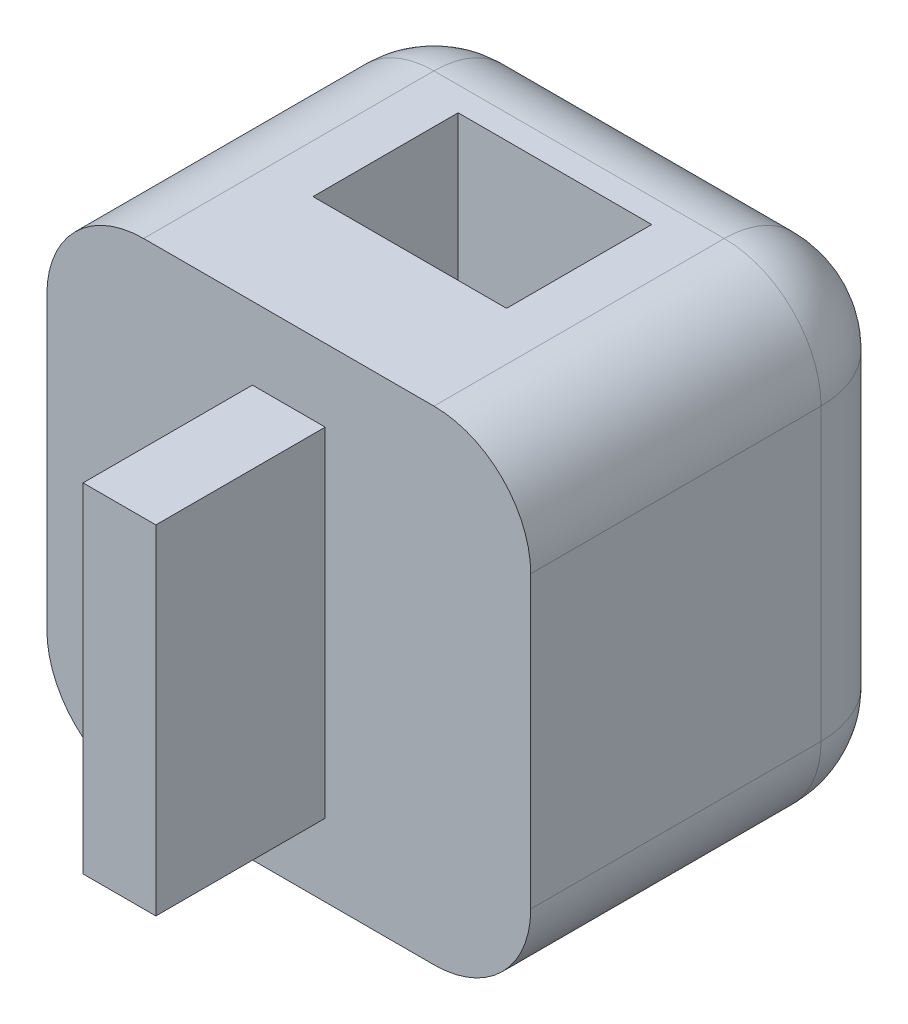
ISO-10303-21;
HEADER;
FILE_DESCRIPTION(('STEP AP214'),'2;1');
FILE_NAME('part.step','',(''),(''),'','','');
FILE_SCHEMA(('AUTOMOTIVE_DESIGN { 1 0 10303 214 1 1 1 1 }'));
ENDSEC;
DATA;
#1=APPLICATION_CONTEXT('core data for automotive mechanical design processes');
#2=APPLICATION_PROTOCOL_DEFINITION('international standard','automotive_design',2000,#1);
#3=PRODUCT_CONTEXT('',#1,'mechanical');
#4=PRODUCT('Part','Part','',(#3));
#5=PRODUCT_RELATED_PRODUCT_CATEGORY('part','',(#4));
#6=PRODUCT_DEFINITION_FORMATION('','',#4);
#7=PRODUCT_DEFINITION_CONTEXT('part definition',#1,'design');
#8=PRODUCT_DEFINITION('design','',#6,#7);
#9=PRODUCT_DEFINITION_SHAPE('','',#8);
#10=(LENGTH_UNIT() NAMED_UNIT(*) SI_UNIT(.MILLI.,.METRE.));
#11=(NAMED_UNIT(*) PLANE_ANGLE_UNIT() SI_UNIT($,.RADIAN.));
#12=(NAMED_UNIT(*) SI_UNIT($,.STERADIAN.) SOLID_ANGLE_UNIT());
#13=UNCERTAINTY_MEASURE_WITH_UNIT(LENGTH_MEASURE(1.E-05),#10,'distance_accuracy_value','');
#14=(GEOMETRIC_REPRESENTATION_CONTEXT(3) GLOBAL_UNCERTAINTY_ASSIGNED_CONTEXT((#13)) GLOBAL_UNIT_ASSIGNED_CONTEXT((#10,
#11,#12)) REPRESENTATION_CONTEXT('',''));
#15=CARTESIAN_POINT('',(0.,0.,0.));
#16=DIRECTION('',(0.,0.,1.));
#17=DIRECTION('',(1.,0.,0.));
#18=AXIS2_PLACEMENT_3D('',#15,#16,#17);
#19=CARTESIAN_POINT('',(0.,0.,8.));
#20=DIRECTION('',(0.,0.,-1.));
#21=DIRECTION('',(-1.,0.,0.));
#22=AXIS2_PLACEMENT_3D('',#19,#20,#21);
#23=PLANE('',#22);
#24=DIRECTION('',(0.,-1.,0.));
#25=VECTOR('',#24,1.);
#26=CARTESIAN_POINT('',(-5.,-5.,8.));
#27=LINE('',#26,#25);
#28=CARTESIAN_POINT('',(-5.,3.,8.));
#29=VERTEX_POINT('',#28);
#30=CARTESIAN_POINT('',(-5.,-3.,8.));
#31=VERTEX_POINT('',#30);
#32=EDGE_CURVE('E230',#29,#31,#27,.T.);
#33=ORIENTED_EDGE('',*,*,#32,.T.);
#34=CARTESIAN_POINT('',(-3.,-3.,8.));
#35=DIRECTION('',(0.,0.,-1.));
#36=DIRECTION('',(-1.,0.,0.));
#37=AXIS2_PLACEMENT_3D('',#34,#35,#36);
#38=CIRCLE('',#37,2.);
#39=CARTESIAN_POINT('',(-3.,-5.,8.));
#40=VERTEX_POINT('',#39);
#41=EDGE_CURVE('E255',#31,#40,#38,.F.);
#42=ORIENTED_EDGE('',*,*,#41,.T.);
#43=DIRECTION('',(1.,0.,0.));
#44=VECTOR('',#43,1.);
#45=CARTESIAN_POINT('',(-5.,-5.,8.));
#46=LINE('',#45,#44);
#47=CARTESIAN_POINT('',(3.,-5.,8.));
#48=VERTEX_POINT('',#47);
#49=EDGE_CURVE('E233',#40,#48,#46,.T.);
#50=ORIENTED_EDGE('',*,*,#49,.T.);
#51=CARTESIAN_POINT('',(3.,-3.,8.));
#52=DIRECTION('',(0.,0.,-1.));
#53=DIRECTION('',(-1.,0.,0.));
#54=AXIS2_PLACEMENT_3D('',#51,#52,#53);
#55=CIRCLE('',#54,2.);
#56=CARTESIAN_POINT('',(5.,-3.,8.));
#57=VERTEX_POINT('',#56);
#58=EDGE_CURVE('E251',#48,#57,#55,.F.);
#59=ORIENTED_EDGE('',*,*,#58,.T.);
#60=DIRECTION('',(0.,1.,0.));
#61=VECTOR('',#60,1.);
#62=CARTESIAN_POINT('',(5.,-5.,8.));
#63=LINE('',#62,#61);
#64=CARTESIAN_POINT('',(5.,3.,8.));
#65=VERTEX_POINT('',#64);
#66=EDGE_CURVE('E218',#57,#65,#63,.T.);
#67=ORIENTED_EDGE('',*,*,#66,.T.);
#68=CARTESIAN_POINT('',(3.,3.,8.));
#69=DIRECTION('',(0.,0.,-1.));
#70=DIRECTION('',(-1.,0.,0.));
#71=AXIS2_PLACEMENT_3D('',#68,#69,#70);
#72=CIRCLE('',#71,2.);
#73=CARTESIAN_POINT('',(3.,5.,8.));
#74=VERTEX_POINT('',#73);
#75=EDGE_CURVE('E249',#65,#74,#72,.F.);
#76=ORIENTED_EDGE('',*,*,#75,.T.);
#77=DIRECTION('',(-1.,0.,0.));
#78=VECTOR('',#77,1.);
#79=CARTESIAN_POINT('',(-5.,5.,8.));
#80=LINE('',#79,#78);
#81=CARTESIAN_POINT('',(-3.,5.,8.));
#82=VERTEX_POINT('',#81);
#83=EDGE_CURVE('E227',#74,#82,#80,.T.);
#84=ORIENTED_EDGE('',*,*,#83,.T.);
#85=CARTESIAN_POINT('',(-3.,3.,8.));
#86=DIRECTION('',(0.,0.,-1.));
#87=DIRECTION('',(-1.,0.,0.));
#88=AXIS2_PLACEMENT_3D('',#85,#86,#87);
#89=CIRCLE('',#88,2.);
#90=EDGE_CURVE('E253',#82,#29,#89,.F.);
#91=ORIENTED_EDGE('',*,*,#90,.T.);
#92=EDGE_LOOP('',(#33,#42,#50,#59,#67,#76,#84,#91));
#93=FACE_BOUND('',#92,.T.);
#94=DIRECTION('',(0.,-1.,0.));
#95=VECTOR('',#94,1.);
#96=CARTESIAN_POINT('',(-0.752429594362617,-3.5,8.));
#97=LINE('',#96,#95);
#98=CARTESIAN_POINT('',(-0.752429594362617,3.5,8.));
#99=VERTEX_POINT('',#98);
#100=CARTESIAN_POINT('',(-0.752429594362617,-3.5,8.));
#101=VERTEX_POINT('',#100);
#102=EDGE_CURVE('E186',#99,#101,#97,.T.);
#103=ORIENTED_EDGE('',*,*,#102,.F.);
#104=DIRECTION('',(-1.,0.,0.));
#105=VECTOR('',#104,1.);
#106=CARTESIAN_POINT('',(0.752429594362617,3.5,8.));
#107=LINE('',#106,#105);
#108=CARTESIAN_POINT('',(0.752429594362617,3.5,8.));
#109=VERTEX_POINT('',#108);
#110=EDGE_CURVE('E183',#109,#99,#107,.T.);
#111=ORIENTED_EDGE('',*,*,#110,.F.);
#112=DIRECTION('',(0.,1.,0.));
#113=VECTOR('',#112,1.);
#114=CARTESIAN_POINT('',(0.752429594362617,-3.5,8.));
#115=LINE('',#114,#113);
#116=CARTESIAN_POINT('',(0.752429594362617,-3.5,8.));
#117=VERTEX_POINT('',#116);
#118=EDGE_CURVE('E311',#117,#109,#115,.T.);
#119=ORIENTED_EDGE('',*,*,#118,.F.);
#120=DIRECTION('',(1.,0.,0.));
#121=VECTOR('',#120,1.);
#122=CARTESIAN_POINT('',(0.752429594362617,-3.5,8.));
#123=LINE('',#122,#121);
#124=EDGE_CURVE('E309',#101,#117,#123,.T.);
#125=ORIENTED_EDGE('',*,*,#124,.F.);
#126=EDGE_LOOP('',(#103,#111,#119,#125));
#127=FACE_BOUND('',#126,.T.);
#128=ADVANCED_FACE('F34',(#93,#127),#23,.F.);
#129=CARTESIAN_POINT('',(5.,-5.,8.));
#130=DIRECTION('',(-1.,0.,0.));
#131=DIRECTION('',(0.,0.,1.));
#132=AXIS2_PLACEMENT_3D('',#129,#130,#131);
#133=PLANE('',#132);
#134=ORIENTED_EDGE('',*,*,#66,.F.);
#135=DIRECTION('',(0.,0.,-1.));
#136=VECTOR('',#135,1.);
#137=CARTESIAN_POINT('',(5.,-3.,8.));
#138=LINE('',#137,#136);
#139=CARTESIAN_POINT('',(5.,-3.,2.));
#140=VERTEX_POINT('',#139);
#141=EDGE_CURVE('E267',#57,#140,#138,.T.);
#142=ORIENTED_EDGE('',*,*,#141,.T.);
#143=DIRECTION('',(0.,1.,0.));
#144=VECTOR('',#143,1.);
#145=CARTESIAN_POINT('',(5.,5.,2.));
#146=LINE('',#145,#144);
#147=CARTESIAN_POINT('',(5.,3.,2.));
#148=VERTEX_POINT('',#147);
#149=EDGE_CURVE('E263',#140,#148,#146,.T.);
#150=ORIENTED_EDGE('',*,*,#149,.T.);
#151=DIRECTION('',(0.,0.,-1.));
#152=VECTOR('',#151,1.);
#153=CARTESIAN_POINT('',(5.,3.,8.));
#154=LINE('',#153,#152);
#155=EDGE_CURVE('E265',#148,#65,#154,.F.);
#156=ORIENTED_EDGE('',*,*,#155,.T.);
#157=EDGE_LOOP('',(#134,#142,#150,#156));
#158=FACE_BOUND('',#157,.T.);
#159=ADVANCED_FACE('F329',(#158),#133,.F.);
#160=CARTESIAN_POINT('',(-5.,5.,8.));
#161=DIRECTION('',(0.,-1.,0.));
#162=DIRECTION('',(0.,0.,-1.));
#163=AXIS2_PLACEMENT_3D('',#160,#161,#162);
#164=PLANE('',#163);
#165=DIRECTION('',(1.,0.,0.));
#166=VECTOR('',#165,1.);
#167=CARTESIAN_POINT('',(-2.,5.,2.5));
#168=LINE('',#167,#166);
#169=CARTESIAN_POINT('',(-2.,5.,2.5));
#170=VERTEX_POINT('',#169);
#171=CARTESIAN_POINT('',(2.,5.,2.5));
#172=VERTEX_POINT('',#171);
#173=EDGE_CURVE('E205',#170,#172,#168,.T.);
#174=ORIENTED_EDGE('',*,*,#173,.T.);
#175=DIRECTION('',(0.,0.,1.));
#176=VECTOR('',#175,1.);
#177=CARTESIAN_POINT('',(2.,5.,2.5));
#178=LINE('',#177,#176);
#179=CARTESIAN_POINT('',(2.,5.,5.5));
#180=VERTEX_POINT('',#179);
#181=EDGE_CURVE('E195',#172,#180,#178,.T.);
#182=ORIENTED_EDGE('',*,*,#181,.T.);
#183=DIRECTION('',(-1.,0.,0.));
#184=VECTOR('',#183,1.);
#185=CARTESIAN_POINT('',(-2.,5.,5.5));
#186=LINE('',#185,#184);
#187=CARTESIAN_POINT('',(-2.,5.,5.5));
#188=VERTEX_POINT('',#187);
#189=EDGE_CURVE('E198',#180,#188,#186,.T.);
#190=ORIENTED_EDGE('',*,*,#189,.T.);
#191=DIRECTION('',(0.,0.,-1.));
#192=VECTOR('',#191,1.);
#193=CARTESIAN_POINT('',(-2.,5.,2.5));
#194=LINE('',#193,#192);
#195=EDGE_CURVE('E202',#188,#170,#194,.T.);
#196=ORIENTED_EDGE('',*,*,#195,.T.);
#197=EDGE_LOOP('',(#174,#182,#190,#196));
#198=FACE_BOUND('',#197,.T.);
#199=DIRECTION('',(-1.,0.,0.));
#200=VECTOR('',#199,1.);
#201=CARTESIAN_POINT('',(-5.,5.,2.));
#202=LINE('',#201,#200);
#203=CARTESIAN_POINT('',(3.,5.,2.));
#204=VERTEX_POINT('',#203);
#205=CARTESIAN_POINT('',(-3.,5.,2.));
#206=VERTEX_POINT('',#205);
#207=EDGE_CURVE('E257',#204,#206,#202,.T.);
#208=ORIENTED_EDGE('',*,*,#207,.T.);
#209=DIRECTION('',(0.,0.,-1.));
#210=VECTOR('',#209,1.);
#211=CARTESIAN_POINT('',(-3.,5.,8.));
#212=LINE('',#211,#210);
#213=EDGE_CURVE('E261',#206,#82,#212,.F.);
#214=ORIENTED_EDGE('',*,*,#213,.T.);
#215=ORIENTED_EDGE('',*,*,#83,.F.);
#216=DIRECTION('',(0.,0.,-1.));
#217=VECTOR('',#216,1.);
#218=CARTESIAN_POINT('',(3.,5.,8.));
#219=LINE('',#218,#217);
#220=EDGE_CURVE('E259',#74,#204,#219,.T.);
#221=ORIENTED_EDGE('',*,*,#220,.T.);
#222=EDGE_LOOP('',(#208,#214,#215,#221));
#223=FACE_BOUND('',#222,.T.);
#224=ADVANCED_FACE('F335',(#198,#223),#164,.F.);
#225=CARTESIAN_POINT('',(-5.,-5.,8.));
#226=DIRECTION('',(1.,0.,0.));
#227=DIRECTION('',(0.,0.,-1.));
#228=AXIS2_PLACEMENT_3D('',#225,#226,#227);
#229=PLANE('',#228);
#230=DIRECTION('',(0.,-1.,0.));
#231=VECTOR('',#230,1.);
#232=CARTESIAN_POINT('',(-5.,-5.,2.));
#233=LINE('',#232,#231);
#234=CARTESIAN_POINT('',(-5.,3.,2.));
#235=VERTEX_POINT('',#234);
#236=CARTESIAN_POINT('',(-5.,-3.,2.));
#237=VERTEX_POINT('',#236);
#238=EDGE_CURVE('E243',#235,#237,#233,.T.);
#239=ORIENTED_EDGE('',*,*,#238,.T.);
#240=DIRECTION('',(0.,0.,-1.));
#241=VECTOR('',#240,1.);
#242=CARTESIAN_POINT('',(-5.,-3.,8.));
#243=LINE('',#242,#241);
#244=EDGE_CURVE('E247',#237,#31,#243,.F.);
#245=ORIENTED_EDGE('',*,*,#244,.T.);
#246=ORIENTED_EDGE('',*,*,#32,.F.);
#247=DIRECTION('',(0.,0.,-1.));
#248=VECTOR('',#247,1.);
#249=CARTESIAN_POINT('',(-5.,3.,8.));
#250=LINE('',#249,#248);
#251=EDGE_CURVE('E245',#29,#235,#250,.T.);
#252=ORIENTED_EDGE('',*,*,#251,.T.);
#253=EDGE_LOOP('',(#239,#245,#246,#252));
#254=FACE_BOUND('',#253,.T.);
#255=ADVANCED_FACE('F347',(#254),#229,.F.);
#256=CARTESIAN_POINT('',(-5.,-5.,8.));
#257=DIRECTION('',(0.,1.,0.));
#258=DIRECTION('',(0.,0.,1.));
#259=AXIS2_PLACEMENT_3D('',#256,#257,#258);
#260=PLANE('',#259);
#261=ORIENTED_EDGE('',*,*,#49,.F.);
#262=DIRECTION('',(0.,0.,-1.));
#263=VECTOR('',#262,1.);
#264=CARTESIAN_POINT('',(-3.,-5.,8.));
#265=LINE('',#264,#263);
#266=CARTESIAN_POINT('',(-3.,-5.,2.));
#267=VERTEX_POINT('',#266);
#268=EDGE_CURVE('E240',#40,#267,#265,.T.);
#269=ORIENTED_EDGE('',*,*,#268,.T.);
#270=DIRECTION('',(1.,0.,0.));
#271=VECTOR('',#270,1.);
#272=CARTESIAN_POINT('',(5.,-5.,2.));
#273=LINE('',#272,#271);
#274=CARTESIAN_POINT('',(3.,-5.,2.));
#275=VERTEX_POINT('',#274);
#276=EDGE_CURVE('E236',#267,#275,#273,.T.);
#277=ORIENTED_EDGE('',*,*,#276,.T.);
#278=DIRECTION('',(0.,0.,-1.));
#279=VECTOR('',#278,1.);
#280=CARTESIAN_POINT('',(3.,-5.,8.));
#281=LINE('',#280,#279);
#282=EDGE_CURVE('E238',#275,#48,#281,.F.);
#283=ORIENTED_EDGE('',*,*,#282,.T.);
#284=EDGE_LOOP('',(#261,#269,#277,#283));
#285=FACE_BOUND('',#284,.T.);
#286=DIRECTION('',(-1.,0.,0.));
#287=VECTOR('',#286,1.);
#288=CARTESIAN_POINT('',(-2.,-5.,5.5));
#289=LINE('',#288,#287);
#290=CARTESIAN_POINT('',(2.,-5.,5.5));
#291=VERTEX_POINT('',#290);
#292=CARTESIAN_POINT('',(-2.,-5.,5.5));
#293=VERTEX_POINT('',#292);
#294=EDGE_CURVE('E189',#291,#293,#289,.T.);
#295=ORIENTED_EDGE('',*,*,#294,.F.);
#296=DIRECTION('',(0.,0.,1.));
#297=VECTOR('',#296,1.);
#298=CARTESIAN_POINT('',(2.,-5.,2.5));
#299=LINE('',#298,#297);
#300=CARTESIAN_POINT('',(2.,-5.,2.5));
#301=VERTEX_POINT('',#300);
#302=EDGE_CURVE('E187',#301,#291,#299,.T.);
#303=ORIENTED_EDGE('',*,*,#302,.F.);
#304=DIRECTION('',(1.,0.,0.));
#305=VECTOR('',#304,1.);
#306=CARTESIAN_POINT('',(-2.,-5.,2.5));
#307=LINE('',#306,#305);
#308=CARTESIAN_POINT('',(-2.,-5.,2.5));
#309=VERTEX_POINT('',#308);
#310=EDGE_CURVE('E199',#309,#301,#307,.T.);
#311=ORIENTED_EDGE('',*,*,#310,.F.);
#312=DIRECTION('',(0.,0.,-1.));
#313=VECTOR('',#312,1.);
#314=CARTESIAN_POINT('',(-2.,-5.,2.5));
#315=LINE('',#314,#313);
#316=EDGE_CURVE('E211',#293,#309,#315,.T.);
#317=ORIENTED_EDGE('',*,*,#316,.F.);
#318=EDGE_LOOP('',(#295,#303,#311,#317));
#319=FACE_BOUND('',#318,.T.);
#320=ADVANCED_FACE('F344',(#285,#319),#260,.F.);
#321=CARTESIAN_POINT('',(0.,0.,0.));
#322=DIRECTION('',(0.,0.,-1.));
#323=DIRECTION('',(-1.,0.,0.));
#324=AXIS2_PLACEMENT_3D('',#321,#322,#323);
#325=PLANE('',#324);
#326=DIRECTION('',(1.,0.,0.));
#327=VECTOR('',#326,1.);
#328=CARTESIAN_POINT('',(-5.,-3.,0.));
#329=LINE('',#328,#327);
#330=CARTESIAN_POINT('',(3.,-3.,0.));
#331=VERTEX_POINT('',#330);
#332=CARTESIAN_POINT('',(-3.,-3.,0.));
#333=VERTEX_POINT('',#332);
#334=EDGE_CURVE('E43',#331,#333,#329,.F.);
#335=ORIENTED_EDGE('',*,*,#334,.T.);
#336=DIRECTION('',(0.,-1.,0.));
#337=VECTOR('',#336,1.);
#338=CARTESIAN_POINT('',(-3.,5.,0.));
#339=LINE('',#338,#337);
#340=CARTESIAN_POINT('',(-3.,3.,0.));
#341=VERTEX_POINT('',#340);
#342=EDGE_CURVE('E11',#333,#341,#339,.F.);
#343=ORIENTED_EDGE('',*,*,#342,.T.);
#344=DIRECTION('',(-1.,0.,0.));
#345=VECTOR('',#344,1.);
#346=CARTESIAN_POINT('',(5.,3.,0.));
#347=LINE('',#346,#345);
#348=CARTESIAN_POINT('',(3.,3.,0.));
#349=VERTEX_POINT('',#348);
#350=EDGE_CURVE('E271',#341,#349,#347,.F.);
#351=ORIENTED_EDGE('',*,*,#350,.T.);
#352=DIRECTION('',(0.,1.,0.));
#353=VECTOR('',#352,1.);
#354=CARTESIAN_POINT('',(3.,-5.,0.));
#355=LINE('',#354,#353);
#356=EDGE_CURVE('E269',#349,#331,#355,.F.);
#357=ORIENTED_EDGE('',*,*,#356,.T.);
#358=EDGE_LOOP('',(#335,#343,#351,#357));
#359=FACE_BOUND('',#358,.T.);
#360=ADVANCED_FACE('F342',(#359),#325,.T.);
#361=CARTESIAN_POINT('',(2.,5.,2.5));
#362=DIRECTION('',(1.,0.,0.));
#363=DIRECTION('',(0.,0.,-1.));
#364=AXIS2_PLACEMENT_3D('',#361,#362,#363);
#365=PLANE('',#364);
#366=ORIENTED_EDGE('',*,*,#302,.T.);
#367=DIRECTION('',(0.,-1.,0.));
#368=VECTOR('',#367,1.);
#369=CARTESIAN_POINT('',(2.,5.,5.5));
#370=LINE('',#369,#368);
#371=EDGE_CURVE('E207',#180,#291,#370,.T.);
#372=ORIENTED_EDGE('',*,*,#371,.F.);
#373=ORIENTED_EDGE('',*,*,#181,.F.);
#374=DIRECTION('',(0.,-1.,0.));
#375=VECTOR('',#374,1.);
#376=CARTESIAN_POINT('',(2.,5.,2.5));
#377=LINE('',#376,#375);
#378=EDGE_CURVE('E216',#172,#301,#377,.T.);
#379=ORIENTED_EDGE('',*,*,#378,.T.);
#380=EDGE_LOOP('',(#366,#372,#373,#379));
#381=FACE_BOUND('',#380,.T.);
#382=ADVANCED_FACE('F340',(#381),#365,.F.);
#383=CARTESIAN_POINT('',(-2.,5.,2.5));
#384=DIRECTION('',(0.,0.,-1.));
#385=DIRECTION('',(-1.,0.,0.));
#386=AXIS2_PLACEMENT_3D('',#383,#384,#385);
#387=PLANE('',#386);
#388=ORIENTED_EDGE('',*,*,#310,.T.);
#389=ORIENTED_EDGE('',*,*,#378,.F.);
#390=ORIENTED_EDGE('',*,*,#173,.F.);
#391=DIRECTION('',(0.,-1.,0.));
#392=VECTOR('',#391,1.);
#393=CARTESIAN_POINT('',(-2.,5.,2.5));
#394=LINE('',#393,#392);
#395=EDGE_CURVE('E219',#170,#309,#394,.T.);
#396=ORIENTED_EDGE('',*,*,#395,.T.);
#397=EDGE_LOOP('',(#388,#389,#390,#396));
#398=FACE_BOUND('',#397,.T.);
#399=ADVANCED_FACE('F438',(#398),#387,.F.);
#400=CARTESIAN_POINT('',(-2.,5.,2.5));
#401=DIRECTION('',(-1.,0.,0.));
#402=DIRECTION('',(0.,0.,1.));
#403=AXIS2_PLACEMENT_3D('',#400,#401,#402);
#404=PLANE('',#403);
#405=ORIENTED_EDGE('',*,*,#316,.T.);
#406=ORIENTED_EDGE('',*,*,#395,.F.);
#407=ORIENTED_EDGE('',*,*,#195,.F.);
#408=DIRECTION('',(0.,-1.,0.));
#409=VECTOR('',#408,1.);
#410=CARTESIAN_POINT('',(-2.,5.,5.5));
#411=LINE('',#410,#409);
#412=EDGE_CURVE('E221',#188,#293,#411,.T.);
#413=ORIENTED_EDGE('',*,*,#412,.T.);
#414=EDGE_LOOP('',(#405,#406,#407,#413));
#415=FACE_BOUND('',#414,.T.);
#416=ADVANCED_FACE('F440',(#415),#404,.F.);
#417=CARTESIAN_POINT('',(-2.,5.,5.5));
#418=DIRECTION('',(0.,0.,1.));
#419=DIRECTION('',(1.,0.,0.));
#420=AXIS2_PLACEMENT_3D('',#417,#418,#419);
#421=PLANE('',#420);
#422=ORIENTED_EDGE('',*,*,#294,.T.);
#423=ORIENTED_EDGE('',*,*,#412,.F.);
#424=ORIENTED_EDGE('',*,*,#189,.F.);
#425=ORIENTED_EDGE('',*,*,#371,.T.);
#426=EDGE_LOOP('',(#422,#423,#424,#425));
#427=FACE_BOUND('',#426,.T.);
#428=ADVANCED_FACE('F432',(#427),#421,.F.);
#429=CARTESIAN_POINT('',(-0.752429594362617,-3.5,11.5));
#430=DIRECTION('',(1.,0.,0.));
#431=DIRECTION('',(0.,0.,-1.));
#432=AXIS2_PLACEMENT_3D('',#429,#430,#431);
#433=PLANE('',#432);
#434=ORIENTED_EDGE('',*,*,#102,.T.);
#435=DIRECTION('',(0.,0.,-1.));
#436=VECTOR('',#435,1.);
#437=CARTESIAN_POINT('',(-0.752429594362617,-3.5,11.5));
#438=LINE('',#437,#436);
#439=CARTESIAN_POINT('',(-0.752429594362617,-3.5,11.5));
#440=VERTEX_POINT('',#439);
#441=EDGE_CURVE('E167',#440,#101,#438,.T.);
#442=ORIENTED_EDGE('',*,*,#441,.F.);
#443=DIRECTION('',(0.,-1.,0.));
#444=VECTOR('',#443,1.);
#445=CARTESIAN_POINT('',(-0.752429594362617,-3.5,11.5));
#446=LINE('',#445,#444);
#447=CARTESIAN_POINT('',(-0.752429594362617,3.5,11.5));
#448=VERTEX_POINT('',#447);
#449=EDGE_CURVE('E174',#448,#440,#446,.T.);
#450=ORIENTED_EDGE('',*,*,#449,.F.);
#451=DIRECTION('',(0.,0.,-1.));
#452=VECTOR('',#451,1.);
#453=CARTESIAN_POINT('',(-0.752429594362617,3.5,11.5));
#454=LINE('',#453,#452);
#455=EDGE_CURVE('E320',#448,#99,#454,.T.);
#456=ORIENTED_EDGE('',*,*,#455,.T.);
#457=EDGE_LOOP('',(#434,#442,#450,#456));
#458=FACE_BOUND('',#457,.T.);
#459=ADVANCED_FACE('F185',(#458),#433,.F.);
#460=CARTESIAN_POINT('',(0.752429594362617,-3.5,11.5));
#461=DIRECTION('',(0.,1.,0.));
#462=DIRECTION('',(0.,0.,1.));
#463=AXIS2_PLACEMENT_3D('',#460,#461,#462);
#464=PLANE('',#463);
#465=ORIENTED_EDGE('',*,*,#124,.T.);
#466=DIRECTION('',(0.,0.,-1.));
#467=VECTOR('',#466,1.);
#468=CARTESIAN_POINT('',(0.752429594362617,-3.5,11.5));
#469=LINE('',#468,#467);
#470=CARTESIAN_POINT('',(0.752429594362617,-3.5,11.5));
#471=VERTEX_POINT('',#470);
#472=EDGE_CURVE('E170',#471,#117,#469,.T.);
#473=ORIENTED_EDGE('',*,*,#472,.F.);
#474=DIRECTION('',(1.,0.,0.));
#475=VECTOR('',#474,1.);
#476=CARTESIAN_POINT('',(0.752429594362617,-3.5,11.5));
#477=LINE('',#476,#475);
#478=EDGE_CURVE('E162',#440,#471,#477,.T.);
#479=ORIENTED_EDGE('',*,*,#478,.F.);
#480=ORIENTED_EDGE('',*,*,#441,.T.);
#481=EDGE_LOOP('',(#465,#473,#479,#480));
#482=FACE_BOUND('',#481,.T.);
#483=ADVANCED_FACE('F165',(#482),#464,.F.);
#484=CARTESIAN_POINT('',(0.752429594362617,-3.5,11.5));
#485=DIRECTION('',(-1.,0.,0.));
#486=DIRECTION('',(0.,0.,1.));
#487=AXIS2_PLACEMENT_3D('',#484,#485,#486);
#488=PLANE('',#487);
#489=ORIENTED_EDGE('',*,*,#118,.T.);
#490=DIRECTION('',(0.,0.,-1.));
#491=VECTOR('',#490,1.);
#492=CARTESIAN_POINT('',(0.752429594362617,3.5,11.5));
#493=LINE('',#492,#491);
#494=CARTESIAN_POINT('',(0.752429594362617,3.5,11.5));
#495=VERTEX_POINT('',#494);
#496=EDGE_CURVE('E191',#495,#109,#493,.T.);
#497=ORIENTED_EDGE('',*,*,#496,.F.);
#498=DIRECTION('',(0.,1.,0.));
#499=VECTOR('',#498,1.);
#500=CARTESIAN_POINT('',(0.752429594362617,-3.5,11.5));
#501=LINE('',#500,#499);
#502=EDGE_CURVE('E173',#471,#495,#501,.T.);
#503=ORIENTED_EDGE('',*,*,#502,.F.);
#504=ORIENTED_EDGE('',*,*,#472,.T.);
#505=EDGE_LOOP('',(#489,#497,#503,#504));
#506=FACE_BOUND('',#505,.T.);
#507=ADVANCED_FACE('F326',(#506),#488,.F.);
#508=CARTESIAN_POINT('',(0.752429594362617,3.5,11.5));
#509=DIRECTION('',(0.,-1.,0.));
#510=DIRECTION('',(0.,0.,-1.));
#511=AXIS2_PLACEMENT_3D('',#508,#509,#510);
#512=PLANE('',#511);
#513=ORIENTED_EDGE('',*,*,#110,.T.);
#514=ORIENTED_EDGE('',*,*,#455,.F.);
#515=DIRECTION('',(-1.,0.,0.));
#516=VECTOR('',#515,1.);
#517=CARTESIAN_POINT('',(0.752429594362617,3.5,11.5));
#518=LINE('',#517,#516);
#519=EDGE_CURVE('E179',#495,#448,#518,.T.);
#520=ORIENTED_EDGE('',*,*,#519,.F.);
#521=ORIENTED_EDGE('',*,*,#496,.T.);
#522=EDGE_LOOP('',(#513,#514,#520,#521));
#523=FACE_BOUND('',#522,.T.);
#524=ADVANCED_FACE('F324',(#523),#512,.F.);
#525=CARTESIAN_POINT('',(0.,0.,11.5));
#526=DIRECTION('',(0.,0.,1.));
#527=DIRECTION('',(1.,0.,0.));
#528=AXIS2_PLACEMENT_3D('',#525,#526,#527);
#529=PLANE('',#528);
#530=ORIENTED_EDGE('',*,*,#449,.T.);
#531=ORIENTED_EDGE('',*,*,#478,.T.);
#532=ORIENTED_EDGE('',*,*,#502,.T.);
#533=ORIENTED_EDGE('',*,*,#519,.T.);
#534=EDGE_LOOP('',(#530,#531,#532,#533));
#535=FACE_BOUND('',#534,.T.);
#536=ADVANCED_FACE('F177',(#535),#529,.T.);
#537=CARTESIAN_POINT('',(3.,3.,8.));
#538=DIRECTION('',(0.,0.,-1.));
#539=DIRECTION('',(-1.,0.,0.));
#540=AXIS2_PLACEMENT_3D('',#537,#538,#539);
#541=CYLINDRICAL_SURFACE('',#540,2.);
#542=CARTESIAN_POINT('',(3.,3.,2.));
#543=DIRECTION('',(0.,0.,-1.));
#544=DIRECTION('',(-1.,0.,0.));
#545=AXIS2_PLACEMENT_3D('',#542,#543,#544);
#546=CIRCLE('',#545,2.);
#547=EDGE_CURVE('E38',#204,#148,#546,.T.);
#548=ORIENTED_EDGE('',*,*,#547,.F.);
#549=ORIENTED_EDGE('',*,*,#220,.F.);
#550=ORIENTED_EDGE('',*,*,#75,.F.);
#551=ORIENTED_EDGE('',*,*,#155,.F.);
#552=EDGE_LOOP('',(#548,#549,#550,#551));
#553=FACE_BOUND('',#552,.T.);
#554=ADVANCED_FACE('F36',(#553),#541,.T.);
#555=CARTESIAN_POINT('',(3.,3.,2.));
#556=DIRECTION('',(1.,0.,0.));
#557=DIRECTION('',(0.,0.,-1.));
#558=AXIS2_PLACEMENT_3D('',#555,#556,#557);
#559=SPHERICAL_SURFACE('',#558,2.);
#560=CARTESIAN_POINT('',(3.,3.,2.));
#561=DIRECTION('',(1.,0.,0.));
#562=DIRECTION('',(0.,0.,-1.));
#563=AXIS2_PLACEMENT_3D('',#560,#561,#562);
#564=CIRCLE('',#563,2.);
#565=EDGE_CURVE('E297',#204,#349,#564,.F.);
#566=ORIENTED_EDGE('',*,*,#565,.F.);
#567=ORIENTED_EDGE('',*,*,#547,.T.);
#568=CARTESIAN_POINT('',(3.,3.,2.));
#569=DIRECTION('',(0.,1.,0.));
#570=DIRECTION('',(0.,0.,1.));
#571=AXIS2_PLACEMENT_3D('',#568,#569,#570);
#572=CIRCLE('',#571,2.);
#573=EDGE_CURVE('E299',#349,#148,#572,.F.);
#574=ORIENTED_EDGE('',*,*,#573,.F.);
#575=EDGE_LOOP('',(#566,#567,#574));
#576=FACE_BOUND('',#575,.T.);
#577=ADVANCED_FACE('F391',(#576),#559,.T.);
#578=CARTESIAN_POINT('',(3.,-3.,8.));
#579=DIRECTION('',(0.,0.,-1.));
#580=DIRECTION('',(-1.,0.,0.));
#581=AXIS2_PLACEMENT_3D('',#578,#579,#580);
#582=CYLINDRICAL_SURFACE('',#581,2.);
#583=ORIENTED_EDGE('',*,*,#58,.F.);
#584=ORIENTED_EDGE('',*,*,#282,.F.);
#585=CARTESIAN_POINT('',(3.,-3.,2.));
#586=DIRECTION('',(0.,0.,-1.));
#587=DIRECTION('',(-1.,0.,0.));
#588=AXIS2_PLACEMENT_3D('',#585,#586,#587);
#589=CIRCLE('',#588,2.);
#590=EDGE_CURVE('E294',#140,#275,#589,.T.);
#591=ORIENTED_EDGE('',*,*,#590,.F.);
#592=ORIENTED_EDGE('',*,*,#141,.F.);
#593=EDGE_LOOP('',(#583,#584,#591,#592));
#594=FACE_BOUND('',#593,.T.);
#595=ADVANCED_FACE('F389',(#594),#582,.T.);
#596=CARTESIAN_POINT('',(3.,-5.,2.));
#597=DIRECTION('',(0.,-1.,0.));
#598=DIRECTION('',(0.,0.,-1.));
#599=AXIS2_PLACEMENT_3D('',#596,#597,#598);
#600=CYLINDRICAL_SURFACE('',#599,2.);
#601=ORIENTED_EDGE('',*,*,#573,.T.);
#602=ORIENTED_EDGE('',*,*,#149,.F.);
#603=CARTESIAN_POINT('',(3.,-3.,2.));
#604=DIRECTION('',(0.,-1.,0.));
#605=DIRECTION('',(0.,0.,-1.));
#606=AXIS2_PLACEMENT_3D('',#603,#604,#605);
#607=CIRCLE('',#606,2.);
#608=EDGE_CURVE('E291',#331,#140,#607,.T.);
#609=ORIENTED_EDGE('',*,*,#608,.F.);
#610=ORIENTED_EDGE('',*,*,#356,.F.);
#611=EDGE_LOOP('',(#601,#602,#609,#610));
#612=FACE_BOUND('',#611,.T.);
#613=ADVANCED_FACE('F385',(#612),#600,.T.);
#614=CARTESIAN_POINT('',(-5.,3.,2.));
#615=DIRECTION('',(1.,0.,0.));
#616=DIRECTION('',(0.,0.,-1.));
#617=AXIS2_PLACEMENT_3D('',#614,#615,#616);
#618=CYLINDRICAL_SURFACE('',#617,2.);
#619=ORIENTED_EDGE('',*,*,#565,.T.);
#620=ORIENTED_EDGE('',*,*,#350,.F.);
#621=CARTESIAN_POINT('',(-3.,3.,2.));
#622=DIRECTION('',(-1.,0.,0.));
#623=DIRECTION('',(0.,0.,1.));
#624=AXIS2_PLACEMENT_3D('',#621,#622,#623);
#625=CIRCLE('',#624,2.);
#626=EDGE_CURVE('E288',#206,#341,#625,.T.);
#627=ORIENTED_EDGE('',*,*,#626,.F.);
#628=ORIENTED_EDGE('',*,*,#207,.F.);
#629=EDGE_LOOP('',(#619,#620,#627,#628));
#630=FACE_BOUND('',#629,.T.);
#631=ADVANCED_FACE('F381',(#630),#618,.T.);
#632=CARTESIAN_POINT('',(-3.,3.,8.));
#633=DIRECTION('',(0.,0.,-1.));
#634=DIRECTION('',(-1.,0.,0.));
#635=AXIS2_PLACEMENT_3D('',#632,#633,#634);
#636=CYLINDRICAL_SURFACE('',#635,2.);
#637=ORIENTED_EDGE('',*,*,#90,.F.);
#638=ORIENTED_EDGE('',*,*,#213,.F.);
#639=CARTESIAN_POINT('',(-3.,3.,2.));
#640=DIRECTION('',(0.,0.,-1.));
#641=DIRECTION('',(-1.,0.,0.));
#642=AXIS2_PLACEMENT_3D('',#639,#640,#641);
#643=CIRCLE('',#642,2.);
#644=EDGE_CURVE('E285',#235,#206,#643,.T.);
#645=ORIENTED_EDGE('',*,*,#644,.F.);
#646=ORIENTED_EDGE('',*,*,#251,.F.);
#647=EDGE_LOOP('',(#637,#638,#645,#646));
#648=FACE_BOUND('',#647,.T.);
#649=ADVANCED_FACE('F377',(#648),#636,.T.);
#650=CARTESIAN_POINT('',(3.,-3.,2.));
#651=DIRECTION('',(1.,0.,0.));
#652=DIRECTION('',(0.,0.,-1.));
#653=AXIS2_PLACEMENT_3D('',#650,#651,#652);
#654=SPHERICAL_SURFACE('',#653,2.);
#655=ORIENTED_EDGE('',*,*,#608,.T.);
#656=ORIENTED_EDGE('',*,*,#590,.T.);
#657=CARTESIAN_POINT('',(3.,-3.,2.));
#658=DIRECTION('',(1.,0.,0.));
#659=DIRECTION('',(0.,0.,-1.));
#660=AXIS2_PLACEMENT_3D('',#657,#658,#659);
#661=CIRCLE('',#660,2.);
#662=EDGE_CURVE('E282',#331,#275,#661,.F.);
#663=ORIENTED_EDGE('',*,*,#662,.F.);
#664=EDGE_LOOP('',(#655,#656,#663));
#665=FACE_BOUND('',#664,.T.);
#666=ADVANCED_FACE('F373',(#665),#654,.T.);
#667=CARTESIAN_POINT('',(-3.,3.,2.));
#668=DIRECTION('',(0.,1.,0.));
#669=DIRECTION('',(0.,0.,1.));
#670=AXIS2_PLACEMENT_3D('',#667,#668,#669);
#671=SPHERICAL_SURFACE('',#670,2.);
#672=ORIENTED_EDGE('',*,*,#644,.T.);
#673=ORIENTED_EDGE('',*,*,#626,.T.);
#674=CARTESIAN_POINT('',(-3.,3.,2.));
#675=DIRECTION('',(0.,1.,0.));
#676=DIRECTION('',(0.,0.,1.));
#677=AXIS2_PLACEMENT_3D('',#674,#675,#676);
#678=CIRCLE('',#677,2.);
#679=EDGE_CURVE('E279',#235,#341,#678,.F.);
#680=ORIENTED_EDGE('',*,*,#679,.F.);
#681=EDGE_LOOP('',(#672,#673,#680));
#682=FACE_BOUND('',#681,.T.);
#683=ADVANCED_FACE('F369',(#682),#671,.T.);
#684=CARTESIAN_POINT('',(-5.,-3.,2.));
#685=DIRECTION('',(-1.,0.,0.));
#686=DIRECTION('',(0.,0.,1.));
#687=AXIS2_PLACEMENT_3D('',#684,#685,#686);
#688=CYLINDRICAL_SURFACE('',#687,2.);
#689=ORIENTED_EDGE('',*,*,#662,.T.);
#690=ORIENTED_EDGE('',*,*,#276,.F.);
#691=CARTESIAN_POINT('',(-3.,-3.,2.));
#692=DIRECTION('',(-1.,0.,0.));
#693=DIRECTION('',(0.,0.,1.));
#694=AXIS2_PLACEMENT_3D('',#691,#692,#693);
#695=CIRCLE('',#694,2.);
#696=EDGE_CURVE('E277',#333,#267,#695,.T.);
#697=ORIENTED_EDGE('',*,*,#696,.F.);
#698=ORIENTED_EDGE('',*,*,#334,.F.);
#699=EDGE_LOOP('',(#689,#690,#697,#698));
#700=FACE_BOUND('',#699,.T.);
#701=ADVANCED_FACE('F365',(#700),#688,.T.);
#702=CARTESIAN_POINT('',(-3.,-5.,2.));
#703=DIRECTION('',(0.,1.,0.));
#704=DIRECTION('',(0.,0.,1.));
#705=AXIS2_PLACEMENT_3D('',#702,#703,#704);
#706=CYLINDRICAL_SURFACE('',#705,2.);
#707=ORIENTED_EDGE('',*,*,#679,.T.);
#708=ORIENTED_EDGE('',*,*,#342,.F.);
#709=CARTESIAN_POINT('',(-3.,-3.,2.));
#710=DIRECTION('',(0.,-1.,0.));
#711=DIRECTION('',(0.,0.,-1.));
#712=AXIS2_PLACEMENT_3D('',#709,#710,#711);
#713=CIRCLE('',#712,2.);
#714=EDGE_CURVE('E51',#237,#333,#713,.T.);
#715=ORIENTED_EDGE('',*,*,#714,.F.);
#716=ORIENTED_EDGE('',*,*,#238,.F.);
#717=EDGE_LOOP('',(#707,#708,#715,#716));
#718=FACE_BOUND('',#717,.T.);
#719=ADVANCED_FACE('F362',(#718),#706,.T.);
#720=CARTESIAN_POINT('',(-3.,-3.,2.));
#721=DIRECTION('',(0.,0.,-1.));
#722=DIRECTION('',(-1.,0.,0.));
#723=AXIS2_PLACEMENT_3D('',#720,#721,#722);
#724=SPHERICAL_SURFACE('',#723,2.);
#725=ORIENTED_EDGE('',*,*,#714,.T.);
#726=ORIENTED_EDGE('',*,*,#696,.T.);
#727=CARTESIAN_POINT('',(-3.,-3.,2.));
#728=DIRECTION('',(0.,0.,-1.));
#729=DIRECTION('',(-1.,0.,0.));
#730=AXIS2_PLACEMENT_3D('',#727,#728,#729);
#731=CIRCLE('',#730,2.);
#732=EDGE_CURVE('E274',#237,#267,#731,.F.);
#733=ORIENTED_EDGE('',*,*,#732,.F.);
#734=EDGE_LOOP('',(#725,#726,#733));
#735=FACE_BOUND('',#734,.T.);
#736=ADVANCED_FACE('F358',(#735),#724,.T.);
#737=CARTESIAN_POINT('',(-3.,-3.,8.));
#738=DIRECTION('',(0.,0.,-1.));
#739=DIRECTION('',(-1.,0.,0.));
#740=AXIS2_PLACEMENT_3D('',#737,#738,#739);
#741=CYLINDRICAL_SURFACE('',#740,2.);
#742=ORIENTED_EDGE('',*,*,#41,.F.);
#743=ORIENTED_EDGE('',*,*,#244,.F.);
#744=ORIENTED_EDGE('',*,*,#732,.T.);
#745=ORIENTED_EDGE('',*,*,#268,.F.);
#746=EDGE_LOOP('',(#742,#743,#744,#745));
#747=FACE_BOUND('',#746,.T.);
#748=ADVANCED_FACE('F355',(#747),#741,.T.);
#749=CLOSED_SHELL('',(#128,#159,#224,#255,#320,#360,#382,#399,#416,#428,#459,#483,#507,#524,
#536,#554,#577,#595,#613,#631,#649,#666,#683,#701,#719,#736,#748));
#750=MANIFOLD_SOLID_BREP('B2',#749);
#751=ADVANCED_BREP_SHAPE_REPRESENTATION('',(#18,#750),#14);
#752=SHAPE_DEFINITION_REPRESENTATION(#9,#751);
ENDSEC;
END-ISO-10303-21;
